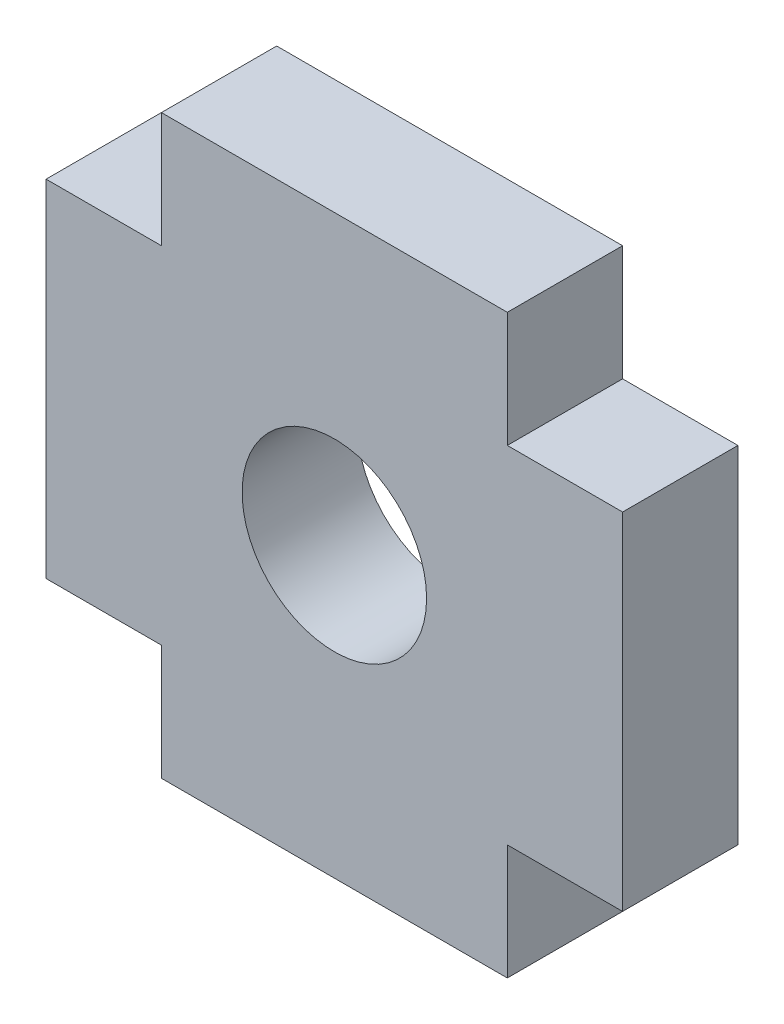
ISO-10303-21;
HEADER;
FILE_DESCRIPTION(('STEP AP214'),'2;1');
FILE_NAME('part.step','',(''),(''),'','','');
FILE_SCHEMA(('AUTOMOTIVE_DESIGN { 1 0 10303 214 1 1 1 1 }'));
ENDSEC;
DATA;
#1=APPLICATION_CONTEXT('core data for automotive mechanical design processes');
#2=APPLICATION_PROTOCOL_DEFINITION('international standard','automotive_design',2000,#1);
#3=PRODUCT_CONTEXT('',#1,'mechanical');
#4=PRODUCT('Part','Part','',(#3));
#5=PRODUCT_RELATED_PRODUCT_CATEGORY('part','',(#4));
#6=PRODUCT_DEFINITION_FORMATION('','',#4);
#7=PRODUCT_DEFINITION_CONTEXT('part definition',#1,'design');
#8=PRODUCT_DEFINITION('design','',#6,#7);
#9=PRODUCT_DEFINITION_SHAPE('','',#8);
#10=(LENGTH_UNIT() NAMED_UNIT(*) SI_UNIT(.MILLI.,.METRE.));
#11=(NAMED_UNIT(*) PLANE_ANGLE_UNIT() SI_UNIT($,.RADIAN.));
#12=(NAMED_UNIT(*) SI_UNIT($,.STERADIAN.) SOLID_ANGLE_UNIT());
#13=UNCERTAINTY_MEASURE_WITH_UNIT(LENGTH_MEASURE(1.E-05),#10,'distance_accuracy_value','');
#14=(GEOMETRIC_REPRESENTATION_CONTEXT(3) GLOBAL_UNCERTAINTY_ASSIGNED_CONTEXT((#13)) GLOBAL_UNIT_ASSIGNED_CONTEXT((#10,
#11,#12)) REPRESENTATION_CONTEXT('',''));
#15=CARTESIAN_POINT('',(0.,0.,0.));
#16=DIRECTION('',(0.,0.,1.));
#17=DIRECTION('',(1.,0.,0.));
#18=AXIS2_PLACEMENT_3D('',#15,#16,#17);
#19=CARTESIAN_POINT('',(0.,0.,2.));
#20=DIRECTION('',(0.,0.,-1.));
#21=DIRECTION('',(-1.,0.,0.));
#22=AXIS2_PLACEMENT_3D('',#19,#20,#21);
#23=PLANE('',#22);
#24=DIRECTION('',(1.,0.,0.));
#25=VECTOR('',#24,1.);
#26=CARTESIAN_POINT('',(6.,0.,2.));
#27=LINE('',#26,#25);
#28=CARTESIAN_POINT('',(0.,0.,2.));
#29=VERTEX_POINT('',#28);
#30=CARTESIAN_POINT('',(6.,0.,2.));
#31=VERTEX_POINT('',#30);
#32=EDGE_CURVE('E176',#29,#31,#27,.T.);
#33=ORIENTED_EDGE('',*,*,#32,.T.);
#34=DIRECTION('',(0.,1.,0.));
#35=VECTOR('',#34,1.);
#36=CARTESIAN_POINT('',(6.00000000000001,2.,2.));
#37=LINE('',#36,#35);
#38=CARTESIAN_POINT('',(6.00000000000001,2.,2.));
#39=VERTEX_POINT('',#38);
#40=EDGE_CURVE('E104',#31,#39,#37,.T.);
#41=ORIENTED_EDGE('',*,*,#40,.T.);
#42=DIRECTION('',(1.,0.,0.));
#43=VECTOR('',#42,1.);
#44=CARTESIAN_POINT('',(8.,2.,2.));
#45=LINE('',#44,#43);
#46=CARTESIAN_POINT('',(8.,2.,2.));
#47=VERTEX_POINT('',#46);
#48=EDGE_CURVE('E203',#39,#47,#45,.T.);
#49=ORIENTED_EDGE('',*,*,#48,.T.);
#50=DIRECTION('',(0.,1.,0.));
#51=VECTOR('',#50,1.);
#52=CARTESIAN_POINT('',(8.,8.,2.));
#53=LINE('',#52,#51);
#54=CARTESIAN_POINT('',(8.,8.,2.));
#55=VERTEX_POINT('',#54);
#56=EDGE_CURVE('E222',#47,#55,#53,.T.);
#57=ORIENTED_EDGE('',*,*,#56,.T.);
#58=DIRECTION('',(-1.,0.,0.));
#59=VECTOR('',#58,1.);
#60=CARTESIAN_POINT('',(6.,8.,2.));
#61=LINE('',#60,#59);
#62=CARTESIAN_POINT('',(6.,8.,2.));
#63=VERTEX_POINT('',#62);
#64=EDGE_CURVE('E219',#55,#63,#61,.T.);
#65=ORIENTED_EDGE('',*,*,#64,.T.);
#66=DIRECTION('',(0.,1.,0.));
#67=VECTOR('',#66,1.);
#68=CARTESIAN_POINT('',(6.,10.,2.));
#69=LINE('',#68,#67);
#70=CARTESIAN_POINT('',(6.,10.,2.));
#71=VERTEX_POINT('',#70);
#72=EDGE_CURVE('E221',#63,#71,#69,.T.);
#73=ORIENTED_EDGE('',*,*,#72,.T.);
#74=DIRECTION('',(-1.,0.,0.));
#75=VECTOR('',#74,1.);
#76=CARTESIAN_POINT('',(0.,10.,2.));
#77=LINE('',#76,#75);
#78=CARTESIAN_POINT('',(0.,10.,2.));
#79=VERTEX_POINT('',#78);
#80=EDGE_CURVE('E224',#71,#79,#77,.T.);
#81=ORIENTED_EDGE('',*,*,#80,.T.);
#82=DIRECTION('',(0.,-1.,0.));
#83=VECTOR('',#82,1.);
#84=CARTESIAN_POINT('',(0.,8.,2.));
#85=LINE('',#84,#83);
#86=CARTESIAN_POINT('',(0.,8.,2.));
#87=VERTEX_POINT('',#86);
#88=EDGE_CURVE('E230',#79,#87,#85,.T.);
#89=ORIENTED_EDGE('',*,*,#88,.T.);
#90=DIRECTION('',(-1.,0.,0.));
#91=VECTOR('',#90,1.);
#92=CARTESIAN_POINT('',(-2.,8.,2.));
#93=LINE('',#92,#91);
#94=CARTESIAN_POINT('',(-2.,8.,2.));
#95=VERTEX_POINT('',#94);
#96=EDGE_CURVE('E135',#87,#95,#93,.T.);
#97=ORIENTED_EDGE('',*,*,#96,.T.);
#98=DIRECTION('',(0.,-1.,0.));
#99=VECTOR('',#98,1.);
#100=CARTESIAN_POINT('',(-2.,2.,2.));
#101=LINE('',#100,#99);
#102=CARTESIAN_POINT('',(-2.,2.,2.));
#103=VERTEX_POINT('',#102);
#104=EDGE_CURVE('E129',#95,#103,#101,.T.);
#105=ORIENTED_EDGE('',*,*,#104,.T.);
#106=DIRECTION('',(1.,0.,0.));
#107=VECTOR('',#106,1.);
#108=CARTESIAN_POINT('',(0.,2.,2.));
#109=LINE('',#108,#107);
#110=CARTESIAN_POINT('',(0.,2.,2.));
#111=VERTEX_POINT('',#110);
#112=EDGE_CURVE('E133',#103,#111,#109,.T.);
#113=ORIENTED_EDGE('',*,*,#112,.T.);
#114=DIRECTION('',(0.,-1.,0.));
#115=VECTOR('',#114,1.);
#116=CARTESIAN_POINT('',(0.,0.,2.));
#117=LINE('',#116,#115);
#118=EDGE_CURVE('E49',#111,#29,#117,.T.);
#119=ORIENTED_EDGE('',*,*,#118,.T.);
#120=EDGE_LOOP('',(#33,#41,#49,#57,#65,#73,#81,#89,#97,#105,#113,#119));
#121=FACE_BOUND('',#120,.T.);
#122=CARTESIAN_POINT('',(3.,5.00000000000006,2.));
#123=DIRECTION('',(0.,0.,1.));
#124=DIRECTION('',(1.,0.,0.));
#125=AXIS2_PLACEMENT_3D('',#122,#123,#124);
#126=CIRCLE('',#125,1.6);
#127=CARTESIAN_POINT('',(4.6,5.00000000000006,2.));
#128=VERTEX_POINT('',#127);
#129=EDGE_CURVE('E157',#128,#128,#126,.T.);
#130=ORIENTED_EDGE('',*,*,#129,.F.);
#131=EDGE_LOOP('',(#130));
#132=FACE_BOUND('',#131,.T.);
#133=ADVANCED_FACE('F32',(#121,#132),#23,.F.);
#134=CARTESIAN_POINT('',(0.,0.,0.));
#135=DIRECTION('',(0.,0.,-1.));
#136=DIRECTION('',(-1.,0.,0.));
#137=AXIS2_PLACEMENT_3D('',#134,#135,#136);
#138=PLANE('',#137);
#139=DIRECTION('',(1.,0.,0.));
#140=VECTOR('',#139,1.);
#141=CARTESIAN_POINT('',(6.,0.,0.));
#142=LINE('',#141,#140);
#143=CARTESIAN_POINT('',(0.,0.,0.));
#144=VERTEX_POINT('',#143);
#145=CARTESIAN_POINT('',(6.,0.,0.));
#146=VERTEX_POINT('',#145);
#147=EDGE_CURVE('E153',#144,#146,#142,.T.);
#148=ORIENTED_EDGE('',*,*,#147,.F.);
#149=DIRECTION('',(0.,-1.,0.));
#150=VECTOR('',#149,1.);
#151=CARTESIAN_POINT('',(0.,0.,0.));
#152=LINE('',#151,#150);
#153=CARTESIAN_POINT('',(0.,2.,0.));
#154=VERTEX_POINT('',#153);
#155=EDGE_CURVE('E96',#154,#144,#152,.T.);
#156=ORIENTED_EDGE('',*,*,#155,.F.);
#157=DIRECTION('',(1.,0.,0.));
#158=VECTOR('',#157,1.);
#159=CARTESIAN_POINT('',(0.,2.,0.));
#160=LINE('',#159,#158);
#161=CARTESIAN_POINT('',(-2.,2.,0.));
#162=VERTEX_POINT('',#161);
#163=EDGE_CURVE('E90',#162,#154,#160,.T.);
#164=ORIENTED_EDGE('',*,*,#163,.F.);
#165=DIRECTION('',(0.,-1.,0.));
#166=VECTOR('',#165,1.);
#167=CARTESIAN_POINT('',(-2.,2.,0.));
#168=LINE('',#167,#166);
#169=CARTESIAN_POINT('',(-2.,8.,0.));
#170=VERTEX_POINT('',#169);
#171=EDGE_CURVE('E143',#170,#162,#168,.T.);
#172=ORIENTED_EDGE('',*,*,#171,.F.);
#173=DIRECTION('',(-1.,0.,0.));
#174=VECTOR('',#173,1.);
#175=CARTESIAN_POINT('',(-2.,8.,0.));
#176=LINE('',#175,#174);
#177=CARTESIAN_POINT('',(0.,8.,0.));
#178=VERTEX_POINT('',#177);
#179=EDGE_CURVE('E171',#178,#170,#176,.T.);
#180=ORIENTED_EDGE('',*,*,#179,.F.);
#181=DIRECTION('',(0.,-1.,0.));
#182=VECTOR('',#181,1.);
#183=CARTESIAN_POINT('',(0.,8.,0.));
#184=LINE('',#183,#182);
#185=CARTESIAN_POINT('',(0.,10.,0.));
#186=VERTEX_POINT('',#185);
#187=EDGE_CURVE('E169',#186,#178,#184,.T.);
#188=ORIENTED_EDGE('',*,*,#187,.F.);
#189=DIRECTION('',(-1.,0.,0.));
#190=VECTOR('',#189,1.);
#191=CARTESIAN_POINT('',(0.,10.,0.));
#192=LINE('',#191,#190);
#193=CARTESIAN_POINT('',(6.,10.,0.));
#194=VERTEX_POINT('',#193);
#195=EDGE_CURVE('E167',#194,#186,#192,.T.);
#196=ORIENTED_EDGE('',*,*,#195,.F.);
#197=DIRECTION('',(0.,1.,0.));
#198=VECTOR('',#197,1.);
#199=CARTESIAN_POINT('',(6.,10.,0.));
#200=LINE('',#199,#198);
#201=CARTESIAN_POINT('',(6.,8.,0.));
#202=VERTEX_POINT('',#201);
#203=EDGE_CURVE('E165',#202,#194,#200,.T.);
#204=ORIENTED_EDGE('',*,*,#203,.F.);
#205=DIRECTION('',(-1.,0.,0.));
#206=VECTOR('',#205,1.);
#207=CARTESIAN_POINT('',(6.,8.,0.));
#208=LINE('',#207,#206);
#209=CARTESIAN_POINT('',(8.,8.,0.));
#210=VERTEX_POINT('',#209);
#211=EDGE_CURVE('E163',#210,#202,#208,.T.);
#212=ORIENTED_EDGE('',*,*,#211,.F.);
#213=DIRECTION('',(0.,1.,0.));
#214=VECTOR('',#213,1.);
#215=CARTESIAN_POINT('',(8.,8.,0.));
#216=LINE('',#215,#214);
#217=CARTESIAN_POINT('',(8.,2.,0.));
#218=VERTEX_POINT('',#217);
#219=EDGE_CURVE('E161',#218,#210,#216,.T.);
#220=ORIENTED_EDGE('',*,*,#219,.F.);
#221=DIRECTION('',(1.,0.,0.));
#222=VECTOR('',#221,1.);
#223=CARTESIAN_POINT('',(8.,2.,0.));
#224=LINE('',#223,#222);
#225=CARTESIAN_POINT('',(6.00000000000001,2.,0.));
#226=VERTEX_POINT('',#225);
#227=EDGE_CURVE('E159',#226,#218,#224,.T.);
#228=ORIENTED_EDGE('',*,*,#227,.F.);
#229=DIRECTION('',(0.,1.,0.));
#230=VECTOR('',#229,1.);
#231=CARTESIAN_POINT('',(6.00000000000001,2.,0.));
#232=LINE('',#231,#230);
#233=EDGE_CURVE('E156',#146,#226,#232,.T.);
#234=ORIENTED_EDGE('',*,*,#233,.F.);
#235=EDGE_LOOP('',(#148,#156,#164,#172,#180,#188,#196,#204,#212,#220,#228,#234));
#236=FACE_BOUND('',#235,.T.);
#237=CARTESIAN_POINT('',(3.,5.00000000000006,0.));
#238=DIRECTION('',(0.,0.,1.));
#239=DIRECTION('',(1.,0.,0.));
#240=AXIS2_PLACEMENT_3D('',#237,#238,#239);
#241=CIRCLE('',#240,1.6);
#242=CARTESIAN_POINT('',(4.6,5.00000000000006,0.));
#243=VERTEX_POINT('',#242);
#244=EDGE_CURVE('E377',#243,#243,#241,.T.);
#245=ORIENTED_EDGE('',*,*,#244,.T.);
#246=EDGE_LOOP('',(#245));
#247=FACE_BOUND('',#246,.T.);
#248=ADVANCED_FACE('F207',(#236,#247),#138,.T.);
#249=CARTESIAN_POINT('',(6.,0.,2.));
#250=DIRECTION('',(0.,1.,0.));
#251=DIRECTION('',(-1.,0.,0.));
#252=AXIS2_PLACEMENT_3D('',#249,#250,#251);
#253=PLANE('',#252);
#254=ORIENTED_EDGE('',*,*,#147,.T.);
#255=DIRECTION('',(0.,0.,-1.));
#256=VECTOR('',#255,1.);
#257=CARTESIAN_POINT('',(6.,0.,2.));
#258=LINE('',#257,#256);
#259=EDGE_CURVE('E11',#31,#146,#258,.T.);
#260=ORIENTED_EDGE('',*,*,#259,.F.);
#261=ORIENTED_EDGE('',*,*,#32,.F.);
#262=DIRECTION('',(0.,0.,-1.));
#263=VECTOR('',#262,1.);
#264=CARTESIAN_POINT('',(0.,0.,2.));
#265=LINE('',#264,#263);
#266=EDGE_CURVE('E149',#29,#144,#265,.T.);
#267=ORIENTED_EDGE('',*,*,#266,.T.);
#268=EDGE_LOOP('',(#254,#260,#261,#267));
#269=FACE_BOUND('',#268,.T.);
#270=ADVANCED_FACE('F34',(#269),#253,.F.);
#271=CARTESIAN_POINT('',(6.00000000000001,2.,2.));
#272=DIRECTION('',(-1.,0.,0.));
#273=DIRECTION('',(0.,-1.,0.));
#274=AXIS2_PLACEMENT_3D('',#271,#272,#273);
#275=PLANE('',#274);
#276=ORIENTED_EDGE('',*,*,#233,.T.);
#277=DIRECTION('',(0.,0.,-1.));
#278=VECTOR('',#277,1.);
#279=CARTESIAN_POINT('',(6.00000000000001,2.,2.));
#280=LINE('',#279,#278);
#281=EDGE_CURVE('E41',#39,#226,#280,.T.);
#282=ORIENTED_EDGE('',*,*,#281,.F.);
#283=ORIENTED_EDGE('',*,*,#40,.F.);
#284=ORIENTED_EDGE('',*,*,#259,.T.);
#285=EDGE_LOOP('',(#276,#282,#283,#284));
#286=FACE_BOUND('',#285,.T.);
#287=ADVANCED_FACE('F264',(#286),#275,.F.);
#288=CARTESIAN_POINT('',(8.,2.,2.));
#289=DIRECTION('',(0.,1.,0.));
#290=DIRECTION('',(-1.,0.,0.));
#291=AXIS2_PLACEMENT_3D('',#288,#289,#290);
#292=PLANE('',#291);
#293=ORIENTED_EDGE('',*,*,#227,.T.);
#294=DIRECTION('',(0.,0.,-1.));
#295=VECTOR('',#294,1.);
#296=CARTESIAN_POINT('',(8.,2.,2.));
#297=LINE('',#296,#295);
#298=EDGE_CURVE('E195',#47,#218,#297,.T.);
#299=ORIENTED_EDGE('',*,*,#298,.F.);
#300=ORIENTED_EDGE('',*,*,#48,.F.);
#301=ORIENTED_EDGE('',*,*,#281,.T.);
#302=EDGE_LOOP('',(#293,#299,#300,#301));
#303=FACE_BOUND('',#302,.T.);
#304=ADVANCED_FACE('F201',(#303),#292,.F.);
#305=CARTESIAN_POINT('',(8.,8.,2.));
#306=DIRECTION('',(-1.,0.,0.));
#307=DIRECTION('',(0.,-1.,0.));
#308=AXIS2_PLACEMENT_3D('',#305,#306,#307);
#309=PLANE('',#308);
#310=ORIENTED_EDGE('',*,*,#219,.T.);
#311=DIRECTION('',(0.,0.,-1.));
#312=VECTOR('',#311,1.);
#313=CARTESIAN_POINT('',(8.,8.,2.));
#314=LINE('',#313,#312);
#315=EDGE_CURVE('E192',#55,#210,#314,.T.);
#316=ORIENTED_EDGE('',*,*,#315,.F.);
#317=ORIENTED_EDGE('',*,*,#56,.F.);
#318=ORIENTED_EDGE('',*,*,#298,.T.);
#319=EDGE_LOOP('',(#310,#316,#317,#318));
#320=FACE_BOUND('',#319,.T.);
#321=ADVANCED_FACE('F213',(#320),#309,.F.);
#322=CARTESIAN_POINT('',(6.,8.,2.));
#323=DIRECTION('',(0.,-1.,0.));
#324=DIRECTION('',(1.,0.,0.));
#325=AXIS2_PLACEMENT_3D('',#322,#323,#324);
#326=PLANE('',#325);
#327=ORIENTED_EDGE('',*,*,#211,.T.);
#328=DIRECTION('',(0.,0.,-1.));
#329=VECTOR('',#328,1.);
#330=CARTESIAN_POINT('',(6.,8.,2.));
#331=LINE('',#330,#329);
#332=EDGE_CURVE('E189',#63,#202,#331,.T.);
#333=ORIENTED_EDGE('',*,*,#332,.F.);
#334=ORIENTED_EDGE('',*,*,#64,.F.);
#335=ORIENTED_EDGE('',*,*,#315,.T.);
#336=EDGE_LOOP('',(#327,#333,#334,#335));
#337=FACE_BOUND('',#336,.T.);
#338=ADVANCED_FACE('F217',(#337),#326,.F.);
#339=CARTESIAN_POINT('',(6.,10.,2.));
#340=DIRECTION('',(-1.,0.,0.));
#341=DIRECTION('',(0.,-1.,0.));
#342=AXIS2_PLACEMENT_3D('',#339,#340,#341);
#343=PLANE('',#342);
#344=ORIENTED_EDGE('',*,*,#203,.T.);
#345=DIRECTION('',(0.,0.,-1.));
#346=VECTOR('',#345,1.);
#347=CARTESIAN_POINT('',(6.,10.,2.));
#348=LINE('',#347,#346);
#349=EDGE_CURVE('E186',#71,#194,#348,.T.);
#350=ORIENTED_EDGE('',*,*,#349,.F.);
#351=ORIENTED_EDGE('',*,*,#72,.F.);
#352=ORIENTED_EDGE('',*,*,#332,.T.);
#353=EDGE_LOOP('',(#344,#350,#351,#352));
#354=FACE_BOUND('',#353,.T.);
#355=ADVANCED_FACE('F277',(#354),#343,.F.);
#356=CARTESIAN_POINT('',(0.,10.,2.));
#357=DIRECTION('',(0.,-1.,0.));
#358=DIRECTION('',(0.,0.,-1.));
#359=AXIS2_PLACEMENT_3D('',#356,#357,#358);
#360=PLANE('',#359);
#361=ORIENTED_EDGE('',*,*,#195,.T.);
#362=DIRECTION('',(0.,0.,-1.));
#363=VECTOR('',#362,1.);
#364=CARTESIAN_POINT('',(0.,10.,2.));
#365=LINE('',#364,#363);
#366=EDGE_CURVE('E183',#79,#186,#365,.T.);
#367=ORIENTED_EDGE('',*,*,#366,.F.);
#368=ORIENTED_EDGE('',*,*,#80,.F.);
#369=ORIENTED_EDGE('',*,*,#349,.T.);
#370=EDGE_LOOP('',(#361,#367,#368,#369));
#371=FACE_BOUND('',#370,.T.);
#372=ADVANCED_FACE('F280',(#371),#360,.F.);
#373=CARTESIAN_POINT('',(0.,8.,2.));
#374=DIRECTION('',(1.,0.,0.));
#375=DIRECTION('',(0.,1.,0.));
#376=AXIS2_PLACEMENT_3D('',#373,#374,#375);
#377=PLANE('',#376);
#378=ORIENTED_EDGE('',*,*,#187,.T.);
#379=DIRECTION('',(0.,0.,-1.));
#380=VECTOR('',#379,1.);
#381=CARTESIAN_POINT('',(0.,8.,2.));
#382=LINE('',#381,#380);
#383=EDGE_CURVE('E180',#87,#178,#382,.T.);
#384=ORIENTED_EDGE('',*,*,#383,.F.);
#385=ORIENTED_EDGE('',*,*,#88,.F.);
#386=ORIENTED_EDGE('',*,*,#366,.T.);
#387=EDGE_LOOP('',(#378,#384,#385,#386));
#388=FACE_BOUND('',#387,.T.);
#389=ADVANCED_FACE('F236',(#388),#377,.F.);
#390=CARTESIAN_POINT('',(-2.,8.,2.));
#391=DIRECTION('',(0.,-1.,0.));
#392=DIRECTION('',(0.,0.,-1.));
#393=AXIS2_PLACEMENT_3D('',#390,#391,#392);
#394=PLANE('',#393);
#395=ORIENTED_EDGE('',*,*,#179,.T.);
#396=DIRECTION('',(0.,0.,-1.));
#397=VECTOR('',#396,1.);
#398=CARTESIAN_POINT('',(-2.,8.,2.));
#399=LINE('',#398,#397);
#400=EDGE_CURVE('E144',#95,#170,#399,.T.);
#401=ORIENTED_EDGE('',*,*,#400,.F.);
#402=ORIENTED_EDGE('',*,*,#96,.F.);
#403=ORIENTED_EDGE('',*,*,#383,.T.);
#404=EDGE_LOOP('',(#395,#401,#402,#403));
#405=FACE_BOUND('',#404,.T.);
#406=ADVANCED_FACE('F240',(#405),#394,.F.);
#407=CARTESIAN_POINT('',(-2.,2.,2.));
#408=DIRECTION('',(1.,0.,0.));
#409=DIRECTION('',(0.,0.,-1.));
#410=AXIS2_PLACEMENT_3D('',#407,#408,#409);
#411=PLANE('',#410);
#412=ORIENTED_EDGE('',*,*,#171,.T.);
#413=DIRECTION('',(0.,0.,-1.));
#414=VECTOR('',#413,1.);
#415=CARTESIAN_POINT('',(-2.,2.,2.));
#416=LINE('',#415,#414);
#417=EDGE_CURVE('E140',#103,#162,#416,.T.);
#418=ORIENTED_EDGE('',*,*,#417,.F.);
#419=ORIENTED_EDGE('',*,*,#104,.F.);
#420=ORIENTED_EDGE('',*,*,#400,.T.);
#421=EDGE_LOOP('',(#412,#418,#419,#420));
#422=FACE_BOUND('',#421,.T.);
#423=ADVANCED_FACE('F141',(#422),#411,.F.);
#424=CARTESIAN_POINT('',(0.,2.,2.));
#425=DIRECTION('',(0.,1.,0.));
#426=DIRECTION('',(-1.,0.,0.));
#427=AXIS2_PLACEMENT_3D('',#424,#425,#426);
#428=PLANE('',#427);
#429=ORIENTED_EDGE('',*,*,#163,.T.);
#430=DIRECTION('',(0.,0.,-1.));
#431=VECTOR('',#430,1.);
#432=CARTESIAN_POINT('',(0.,2.,2.));
#433=LINE('',#432,#431);
#434=EDGE_CURVE('E145',#111,#154,#433,.T.);
#435=ORIENTED_EDGE('',*,*,#434,.F.);
#436=ORIENTED_EDGE('',*,*,#112,.F.);
#437=ORIENTED_EDGE('',*,*,#417,.T.);
#438=EDGE_LOOP('',(#429,#435,#436,#437));
#439=FACE_BOUND('',#438,.T.);
#440=ADVANCED_FACE('F147',(#439),#428,.F.);
#441=CARTESIAN_POINT('',(0.,0.,2.));
#442=DIRECTION('',(1.,0.,0.));
#443=DIRECTION('',(0.,0.,-1.));
#444=AXIS2_PLACEMENT_3D('',#441,#442,#443);
#445=PLANE('',#444);
#446=ORIENTED_EDGE('',*,*,#155,.T.);
#447=ORIENTED_EDGE('',*,*,#266,.F.);
#448=ORIENTED_EDGE('',*,*,#118,.F.);
#449=ORIENTED_EDGE('',*,*,#434,.T.);
#450=EDGE_LOOP('',(#446,#447,#448,#449));
#451=FACE_BOUND('',#450,.T.);
#452=ADVANCED_FACE('F244',(#451),#445,.F.);
#453=CARTESIAN_POINT('',(3.,5.00000000000006,2.));
#454=DIRECTION('',(0.,0.,-1.));
#455=DIRECTION('',(-1.,0.,0.));
#456=AXIS2_PLACEMENT_3D('',#453,#454,#455);
#457=CYLINDRICAL_SURFACE('',#456,1.6);
#458=ORIENTED_EDGE('',*,*,#129,.T.);
#459=EDGE_LOOP('',(#458));
#460=FACE_BOUND('',#459,.T.);
#461=ORIENTED_EDGE('',*,*,#244,.F.);
#462=EDGE_LOOP('',(#461));
#463=FACE_BOUND('',#462,.T.);
#464=ADVANCED_FACE('F246',(#460,#463),#457,.F.);
#465=CLOSED_SHELL('',(#133,#248,#270,#287,#304,#321,#338,#355,#372,#389,#406,#423,#440,#452,#464));
#466=MANIFOLD_SOLID_BREP('B2',#465);
#467=ADVANCED_BREP_SHAPE_REPRESENTATION('',(#18,#466),#14);
#468=SHAPE_DEFINITION_REPRESENTATION(#9,#467);
ENDSEC;
END-ISO-10303-21;
